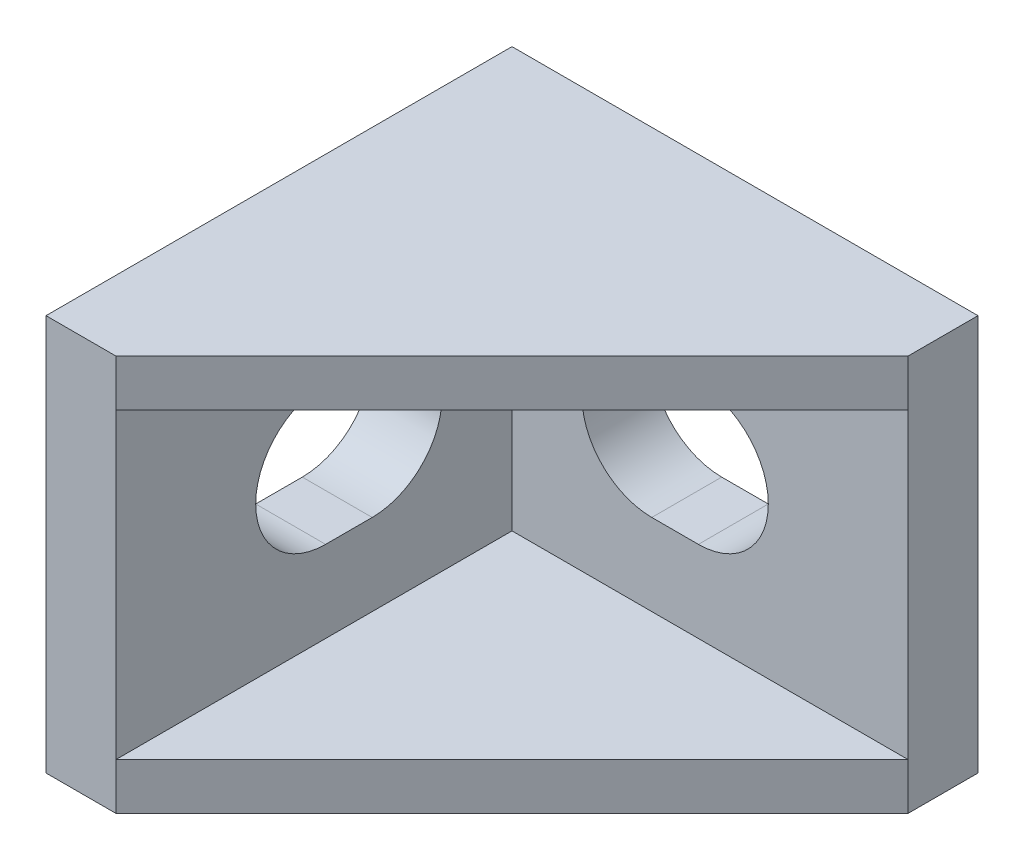
ISO-10303-21;
HEADER;
FILE_DESCRIPTION(('STEP AP214'),'2;1');
FILE_NAME('part.step','',(''),(''),'','','');
FILE_SCHEMA(('AUTOMOTIVE_DESIGN { 1 0 10303 214 1 1 1 1 }'));
ENDSEC;
DATA;
#1=APPLICATION_CONTEXT('core data for automotive mechanical design processes');
#2=APPLICATION_PROTOCOL_DEFINITION('international standard','automotive_design',2000,#1);
#3=PRODUCT_CONTEXT('',#1,'mechanical');
#4=PRODUCT('Part','Part','',(#3));
#5=PRODUCT_RELATED_PRODUCT_CATEGORY('part','',(#4));
#6=PRODUCT_DEFINITION_FORMATION('','',#4);
#7=PRODUCT_DEFINITION_CONTEXT('part definition',#1,'design');
#8=PRODUCT_DEFINITION('design','',#6,#7);
#9=PRODUCT_DEFINITION_SHAPE('','',#8);
#10=(LENGTH_UNIT() NAMED_UNIT(*) SI_UNIT(.MILLI.,.METRE.));
#11=(NAMED_UNIT(*) PLANE_ANGLE_UNIT() SI_UNIT($,.RADIAN.));
#12=(NAMED_UNIT(*) SI_UNIT($,.STERADIAN.) SOLID_ANGLE_UNIT());
#13=UNCERTAINTY_MEASURE_WITH_UNIT(LENGTH_MEASURE(1.E-05),#10,'distance_accuracy_value','');
#14=(GEOMETRIC_REPRESENTATION_CONTEXT(3) GLOBAL_UNCERTAINTY_ASSIGNED_CONTEXT((#13)) GLOBAL_UNIT_ASSIGNED_CONTEXT((#10,
#11,#12)) REPRESENTATION_CONTEXT('',''));
#15=CARTESIAN_POINT('',(0.,0.,0.));
#16=DIRECTION('',(0.,0.,1.));
#17=DIRECTION('',(1.,0.,0.));
#18=AXIS2_PLACEMENT_3D('',#15,#16,#17);
#19=CARTESIAN_POINT('',(20.,17.,3.));
#20=DIRECTION('',(-0.707106781186548,0.,-0.707106781186548));
#21=DIRECTION('',(0.707106781186548,0.,-0.707106781186548));
#22=AXIS2_PLACEMENT_3D('',#19,#20,#21);
#23=PLANE('',#22);
#24=DIRECTION('',(0.,-1.,0.));
#25=VECTOR('',#24,1.);
#26=CARTESIAN_POINT('',(3.,17.,20.));
#27=LINE('',#26,#25);
#28=CARTESIAN_POINT('',(3.,2.,20.));
#29=VERTEX_POINT('',#28);
#30=CARTESIAN_POINT('',(3.,0.,20.));
#31=VERTEX_POINT('',#30);
#32=EDGE_CURVE('E254',#29,#31,#27,.T.);
#33=ORIENTED_EDGE('',*,*,#32,.T.);
#34=DIRECTION('',(-0.707106781186547,0.,0.707106781186547));
#35=VECTOR('',#34,1.);
#36=CARTESIAN_POINT('',(20.,0.,3.));
#37=LINE('',#36,#35);
#38=CARTESIAN_POINT('',(20.,0.,3.));
#39=VERTEX_POINT('',#38);
#40=EDGE_CURVE('E248',#39,#31,#37,.T.);
#41=ORIENTED_EDGE('',*,*,#40,.F.);
#42=DIRECTION('',(0.,-1.,0.));
#43=VECTOR('',#42,1.);
#44=CARTESIAN_POINT('',(20.,17.,3.));
#45=LINE('',#44,#43);
#46=CARTESIAN_POINT('',(20.,2.,3.));
#47=VERTEX_POINT('',#46);
#48=EDGE_CURVE('E258',#47,#39,#45,.T.);
#49=ORIENTED_EDGE('',*,*,#48,.F.);
#50=DIRECTION('',(0.707106781186548,0.,-0.707106781186548));
#51=VECTOR('',#50,1.);
#52=CARTESIAN_POINT('',(20.,2.,3.));
#53=LINE('',#52,#51);
#54=EDGE_CURVE('E11',#29,#47,#53,.T.);
#55=ORIENTED_EDGE('',*,*,#54,.F.);
#56=EDGE_LOOP('',(#33,#41,#49,#55));
#57=FACE_BOUND('',#56,.T.);
#58=ADVANCED_FACE('F35',(#57),#23,.F.);
#59=CARTESIAN_POINT('',(0.,17.,20.));
#60=DIRECTION('',(1.,0.,0.));
#61=DIRECTION('',(0.,0.,1.));
#62=AXIS2_PLACEMENT_3D('',#59,#60,#61);
#63=PLANE('',#62);
#64=DIRECTION('',(0.,0.,1.));
#65=VECTOR('',#64,1.);
#66=CARTESIAN_POINT('',(0.,11.5,9.));
#67=LINE('',#66,#65);
#68=CARTESIAN_POINT('',(0.,11.5,9.));
#69=VERTEX_POINT('',#68);
#70=CARTESIAN_POINT('',(0.,11.5,11.));
#71=VERTEX_POINT('',#70);
#72=EDGE_CURVE('E173',#69,#71,#67,.T.);
#73=ORIENTED_EDGE('',*,*,#72,.T.);
#74=CARTESIAN_POINT('',(0.,8.5,11.));
#75=DIRECTION('',(-1.,0.,0.));
#76=DIRECTION('',(0.,0.,1.));
#77=AXIS2_PLACEMENT_3D('',#74,#75,#76);
#78=CIRCLE('',#77,3.);
#79=CARTESIAN_POINT('',(0.,5.5,11.));
#80=VERTEX_POINT('',#79);
#81=EDGE_CURVE('E170',#71,#80,#78,.F.);
#82=ORIENTED_EDGE('',*,*,#81,.T.);
#83=DIRECTION('',(0.,0.,-1.));
#84=VECTOR('',#83,1.);
#85=CARTESIAN_POINT('',(0.,5.5,9.));
#86=LINE('',#85,#84);
#87=CARTESIAN_POINT('',(0.,5.5,9.));
#88=VERTEX_POINT('',#87);
#89=EDGE_CURVE('E199',#80,#88,#86,.T.);
#90=ORIENTED_EDGE('',*,*,#89,.T.);
#91=CARTESIAN_POINT('',(0.,8.5,9.));
#92=DIRECTION('',(-1.,0.,0.));
#93=DIRECTION('',(0.,0.,1.));
#94=AXIS2_PLACEMENT_3D('',#91,#92,#93);
#95=CIRCLE('',#94,3.);
#96=EDGE_CURVE('E181',#88,#69,#95,.F.);
#97=ORIENTED_EDGE('',*,*,#96,.T.);
#98=EDGE_LOOP('',(#73,#82,#90,#97));
#99=FACE_BOUND('',#98,.T.);
#100=DIRECTION('',(0.,0.,-1.));
#101=VECTOR('',#100,1.);
#102=CARTESIAN_POINT('',(0.,0.,20.));
#103=LINE('',#102,#101);
#104=CARTESIAN_POINT('',(0.,0.,20.));
#105=VERTEX_POINT('',#104);
#106=CARTESIAN_POINT('',(0.,0.,0.));
#107=VERTEX_POINT('',#106);
#108=EDGE_CURVE('E223',#105,#107,#103,.T.);
#109=ORIENTED_EDGE('',*,*,#108,.F.);
#110=DIRECTION('',(0.,-1.,0.));
#111=VECTOR('',#110,1.);
#112=CARTESIAN_POINT('',(0.,17.,20.));
#113=LINE('',#112,#111);
#114=CARTESIAN_POINT('',(0.,17.,20.));
#115=VERTEX_POINT('',#114);
#116=EDGE_CURVE('E240',#115,#105,#113,.T.);
#117=ORIENTED_EDGE('',*,*,#116,.F.);
#118=DIRECTION('',(0.,0.,-1.));
#119=VECTOR('',#118,1.);
#120=CARTESIAN_POINT('',(0.,17.,20.));
#121=LINE('',#120,#119);
#122=CARTESIAN_POINT('',(0.,17.,0.));
#123=VERTEX_POINT('',#122);
#124=EDGE_CURVE('E225',#115,#123,#121,.T.);
#125=ORIENTED_EDGE('',*,*,#124,.T.);
#126=DIRECTION('',(0.,-1.,0.));
#127=VECTOR('',#126,1.);
#128=CARTESIAN_POINT('',(0.,17.,0.));
#129=LINE('',#128,#127);
#130=EDGE_CURVE('E265',#123,#107,#129,.T.);
#131=ORIENTED_EDGE('',*,*,#130,.T.);
#132=EDGE_LOOP('',(#109,#117,#125,#131));
#133=FACE_BOUND('',#132,.T.);
#134=ADVANCED_FACE('F37',(#99,#133),#63,.F.);
#135=CARTESIAN_POINT('',(0.,17.,0.));
#136=DIRECTION('',(0.,0.,1.));
#137=DIRECTION('',(-1.,0.,0.));
#138=AXIS2_PLACEMENT_3D('',#135,#136,#137);
#139=PLANE('',#138);
#140=DIRECTION('',(-1.,0.,0.));
#141=VECTOR('',#140,1.);
#142=CARTESIAN_POINT('',(11.,11.5,0.));
#143=LINE('',#142,#141);
#144=CARTESIAN_POINT('',(11.,11.5,0.));
#145=VERTEX_POINT('',#144);
#146=CARTESIAN_POINT('',(9.,11.5,0.));
#147=VERTEX_POINT('',#146);
#148=EDGE_CURVE('E165',#145,#147,#143,.T.);
#149=ORIENTED_EDGE('',*,*,#148,.T.);
#150=CARTESIAN_POINT('',(9.,8.5,0.));
#151=DIRECTION('',(0.,0.,-1.));
#152=DIRECTION('',(-1.,0.,0.));
#153=AXIS2_PLACEMENT_3D('',#150,#151,#152);
#154=CIRCLE('',#153,3.);
#155=CARTESIAN_POINT('',(9.,5.5,0.));
#156=VERTEX_POINT('',#155);
#157=EDGE_CURVE('E169',#147,#156,#154,.F.);
#158=ORIENTED_EDGE('',*,*,#157,.T.);
#159=DIRECTION('',(1.,0.,0.));
#160=VECTOR('',#159,1.);
#161=CARTESIAN_POINT('',(11.,5.5,0.));
#162=LINE('',#161,#160);
#163=CARTESIAN_POINT('',(11.,5.5,0.));
#164=VERTEX_POINT('',#163);
#165=EDGE_CURVE('E150',#156,#164,#162,.T.);
#166=ORIENTED_EDGE('',*,*,#165,.T.);
#167=CARTESIAN_POINT('',(11.,8.5,0.));
#168=DIRECTION('',(0.,0.,-1.));
#169=DIRECTION('',(-1.,0.,0.));
#170=AXIS2_PLACEMENT_3D('',#167,#168,#169);
#171=CIRCLE('',#170,3.);
#172=EDGE_CURVE('E158',#164,#145,#171,.F.);
#173=ORIENTED_EDGE('',*,*,#172,.T.);
#174=EDGE_LOOP('',(#149,#158,#166,#173));
#175=FACE_BOUND('',#174,.T.);
#176=DIRECTION('',(1.,0.,0.));
#177=VECTOR('',#176,1.);
#178=CARTESIAN_POINT('',(0.,0.,0.));
#179=LINE('',#178,#177);
#180=CARTESIAN_POINT('',(20.,0.,0.));
#181=VERTEX_POINT('',#180);
#182=EDGE_CURVE('E243',#107,#181,#179,.T.);
#183=ORIENTED_EDGE('',*,*,#182,.F.);
#184=ORIENTED_EDGE('',*,*,#130,.F.);
#185=DIRECTION('',(1.,0.,0.));
#186=VECTOR('',#185,1.);
#187=CARTESIAN_POINT('',(0.,17.,0.));
#188=LINE('',#187,#186);
#189=CARTESIAN_POINT('',(20.,17.,0.));
#190=VERTEX_POINT('',#189);
#191=EDGE_CURVE('E228',#123,#190,#188,.T.);
#192=ORIENTED_EDGE('',*,*,#191,.T.);
#193=DIRECTION('',(0.,-1.,0.));
#194=VECTOR('',#193,1.);
#195=CARTESIAN_POINT('',(20.,17.,0.));
#196=LINE('',#195,#194);
#197=EDGE_CURVE('E262',#190,#181,#196,.T.);
#198=ORIENTED_EDGE('',*,*,#197,.T.);
#199=EDGE_LOOP('',(#183,#184,#192,#198));
#200=FACE_BOUND('',#199,.T.);
#201=ADVANCED_FACE('F167',(#175,#200),#139,.F.);
#202=CARTESIAN_POINT('',(20.,17.,0.));
#203=DIRECTION('',(-1.,0.,0.));
#204=DIRECTION('',(0.,0.,-1.));
#205=AXIS2_PLACEMENT_3D('',#202,#203,#204);
#206=PLANE('',#205);
#207=DIRECTION('',(0.,0.,1.));
#208=VECTOR('',#207,1.);
#209=CARTESIAN_POINT('',(20.,0.,0.));
#210=LINE('',#209,#208);
#211=EDGE_CURVE('E246',#181,#39,#210,.T.);
#212=ORIENTED_EDGE('',*,*,#211,.F.);
#213=ORIENTED_EDGE('',*,*,#197,.F.);
#214=DIRECTION('',(0.,0.,1.));
#215=VECTOR('',#214,1.);
#216=CARTESIAN_POINT('',(20.,17.,0.));
#217=LINE('',#216,#215);
#218=CARTESIAN_POINT('',(20.,17.,3.));
#219=VERTEX_POINT('',#218);
#220=EDGE_CURVE('E232',#190,#219,#217,.T.);
#221=ORIENTED_EDGE('',*,*,#220,.T.);
#222=CARTESIAN_POINT('',(20.,15.,3.));
#223=VERTEX_POINT('',#222);
#224=EDGE_CURVE('E259',#219,#223,#45,.T.);
#225=ORIENTED_EDGE('',*,*,#224,.T.);
#226=DIRECTION('',(0.,-1.,0.));
#227=VECTOR('',#226,1.);
#228=CARTESIAN_POINT('',(20.,15.,3.));
#229=LINE('',#228,#227);
#230=EDGE_CURVE('E212',#223,#47,#229,.T.);
#231=ORIENTED_EDGE('',*,*,#230,.T.);
#232=ORIENTED_EDGE('',*,*,#48,.T.);
#233=EDGE_LOOP('',(#212,#213,#221,#225,#231,#232));
#234=FACE_BOUND('',#233,.T.);
#235=ADVANCED_FACE('F297',(#234),#206,.F.);
#236=ORIENTED_EDGE('',*,*,#224,.F.);
#237=DIRECTION('',(-0.707106781186547,0.,0.707106781186547));
#238=VECTOR('',#237,1.);
#239=CARTESIAN_POINT('',(20.,17.,3.));
#240=LINE('',#239,#238);
#241=CARTESIAN_POINT('',(3.,17.,20.));
#242=VERTEX_POINT('',#241);
#243=EDGE_CURVE('E235',#219,#242,#240,.T.);
#244=ORIENTED_EDGE('',*,*,#243,.T.);
#245=CARTESIAN_POINT('',(3.,15.,20.));
#246=VERTEX_POINT('',#245);
#247=EDGE_CURVE('E255',#242,#246,#27,.T.);
#248=ORIENTED_EDGE('',*,*,#247,.T.);
#249=DIRECTION('',(-0.707106781186548,0.,0.707106781186548));
#250=VECTOR('',#249,1.);
#251=CARTESIAN_POINT('',(20.,15.,3.));
#252=LINE('',#251,#250);
#253=EDGE_CURVE('E43',#223,#246,#252,.T.);
#254=ORIENTED_EDGE('',*,*,#253,.F.);
#255=EDGE_LOOP('',(#236,#244,#248,#254));
#256=FACE_BOUND('',#255,.T.);
#257=ADVANCED_FACE('F277',(#256),#23,.F.);
#258=CARTESIAN_POINT('',(3.,17.,20.));
#259=DIRECTION('',(0.,0.,-1.));
#260=DIRECTION('',(1.,0.,0.));
#261=AXIS2_PLACEMENT_3D('',#258,#259,#260);
#262=PLANE('',#261);
#263=DIRECTION('',(-1.,0.,0.));
#264=VECTOR('',#263,1.);
#265=CARTESIAN_POINT('',(3.,0.,20.));
#266=LINE('',#265,#264);
#267=EDGE_CURVE('E229',#31,#105,#266,.T.);
#268=ORIENTED_EDGE('',*,*,#267,.F.);
#269=ORIENTED_EDGE('',*,*,#32,.F.);
#270=DIRECTION('',(0.,1.,0.));
#271=VECTOR('',#270,1.);
#272=CARTESIAN_POINT('',(3.,2.,20.));
#273=LINE('',#272,#271);
#274=EDGE_CURVE('E207',#29,#246,#273,.T.);
#275=ORIENTED_EDGE('',*,*,#274,.T.);
#276=ORIENTED_EDGE('',*,*,#247,.F.);
#277=DIRECTION('',(-1.,0.,0.));
#278=VECTOR('',#277,1.);
#279=CARTESIAN_POINT('',(3.,17.,20.));
#280=LINE('',#279,#278);
#281=EDGE_CURVE('E238',#242,#115,#280,.T.);
#282=ORIENTED_EDGE('',*,*,#281,.T.);
#283=ORIENTED_EDGE('',*,*,#116,.T.);
#284=EDGE_LOOP('',(#268,#269,#275,#276,#282,#283));
#285=FACE_BOUND('',#284,.T.);
#286=ADVANCED_FACE('F279',(#285),#262,.F.);
#287=CARTESIAN_POINT('',(0.,17.,0.));
#288=DIRECTION('',(0.,1.,0.));
#289=DIRECTION('',(0.,0.,-1.));
#290=AXIS2_PLACEMENT_3D('',#287,#288,#289);
#291=PLANE('',#290);
#292=ORIENTED_EDGE('',*,*,#124,.F.);
#293=ORIENTED_EDGE('',*,*,#281,.F.);
#294=ORIENTED_EDGE('',*,*,#243,.F.);
#295=ORIENTED_EDGE('',*,*,#220,.F.);
#296=ORIENTED_EDGE('',*,*,#191,.F.);
#297=EDGE_LOOP('',(#292,#293,#294,#295,#296));
#298=FACE_BOUND('',#297,.T.);
#299=ADVANCED_FACE('F300',(#298),#291,.T.);
#300=CARTESIAN_POINT('',(0.,0.,0.));
#301=DIRECTION('',(0.,1.,0.));
#302=DIRECTION('',(0.,0.,-1.));
#303=AXIS2_PLACEMENT_3D('',#300,#301,#302);
#304=PLANE('',#303);
#305=ORIENTED_EDGE('',*,*,#108,.T.);
#306=ORIENTED_EDGE('',*,*,#182,.T.);
#307=ORIENTED_EDGE('',*,*,#211,.T.);
#308=ORIENTED_EDGE('',*,*,#40,.T.);
#309=ORIENTED_EDGE('',*,*,#267,.T.);
#310=EDGE_LOOP('',(#305,#306,#307,#308,#309));
#311=FACE_BOUND('',#310,.T.);
#312=ADVANCED_FACE('F306',(#311),#304,.F.);
#313=CARTESIAN_POINT('',(20.,2.,3.));
#314=DIRECTION('',(0.,-1.,0.));
#315=DIRECTION('',(0.,0.,1.));
#316=AXIS2_PLACEMENT_3D('',#313,#314,#315);
#317=PLANE('',#316);
#318=DIRECTION('',(0.,0.,1.));
#319=VECTOR('',#318,1.);
#320=CARTESIAN_POINT('',(3.,2.,3.));
#321=LINE('',#320,#319);
#322=CARTESIAN_POINT('',(3.,2.,3.));
#323=VERTEX_POINT('',#322);
#324=EDGE_CURVE('E221',#323,#29,#321,.T.);
#325=ORIENTED_EDGE('',*,*,#324,.T.);
#326=ORIENTED_EDGE('',*,*,#54,.T.);
#327=DIRECTION('',(-1.,0.,0.));
#328=VECTOR('',#327,1.);
#329=CARTESIAN_POINT('',(20.,2.,3.));
#330=LINE('',#329,#328);
#331=EDGE_CURVE('E215',#47,#323,#330,.T.);
#332=ORIENTED_EDGE('',*,*,#331,.T.);
#333=EDGE_LOOP('',(#325,#326,#332));
#334=FACE_BOUND('',#333,.T.);
#335=ADVANCED_FACE('F293',(#334),#317,.F.);
#336=CARTESIAN_POINT('',(3.,15.,3.));
#337=DIRECTION('',(0.,1.,0.));
#338=DIRECTION('',(-1.,0.,0.));
#339=AXIS2_PLACEMENT_3D('',#336,#337,#338);
#340=PLANE('',#339);
#341=DIRECTION('',(1.,0.,0.));
#342=VECTOR('',#341,1.);
#343=CARTESIAN_POINT('',(3.,15.,3.));
#344=LINE('',#343,#342);
#345=CARTESIAN_POINT('',(3.,15.,3.));
#346=VERTEX_POINT('',#345);
#347=EDGE_CURVE('E210',#346,#223,#344,.T.);
#348=ORIENTED_EDGE('',*,*,#347,.T.);
#349=ORIENTED_EDGE('',*,*,#253,.T.);
#350=DIRECTION('',(0.,0.,1.));
#351=VECTOR('',#350,1.);
#352=CARTESIAN_POINT('',(3.,15.,3.));
#353=LINE('',#352,#351);
#354=EDGE_CURVE('E218',#346,#246,#353,.T.);
#355=ORIENTED_EDGE('',*,*,#354,.F.);
#356=EDGE_LOOP('',(#348,#349,#355));
#357=FACE_BOUND('',#356,.T.);
#358=ADVANCED_FACE('F271',(#357),#340,.F.);
#359=CARTESIAN_POINT('',(3.,2.,3.));
#360=DIRECTION('',(-1.,0.,0.));
#361=DIRECTION('',(0.,0.,-1.));
#362=AXIS2_PLACEMENT_3D('',#359,#360,#361);
#363=PLANE('',#362);
#364=DIRECTION('',(0.,0.,1.));
#365=VECTOR('',#364,1.);
#366=CARTESIAN_POINT('',(3.,5.5,9.));
#367=LINE('',#366,#365);
#368=CARTESIAN_POINT('',(3.,5.5,9.));
#369=VERTEX_POINT('',#368);
#370=CARTESIAN_POINT('',(3.,5.5,11.));
#371=VERTEX_POINT('',#370);
#372=EDGE_CURVE('E187',#369,#371,#367,.T.);
#373=ORIENTED_EDGE('',*,*,#372,.T.);
#374=CARTESIAN_POINT('',(3.,8.5,11.));
#375=DIRECTION('',(-1.,0.,0.));
#376=DIRECTION('',(0.,0.,1.));
#377=AXIS2_PLACEMENT_3D('',#374,#375,#376);
#378=CIRCLE('',#377,3.);
#379=CARTESIAN_POINT('',(3.,11.5,11.));
#380=VERTEX_POINT('',#379);
#381=EDGE_CURVE('E190',#371,#380,#378,.T.);
#382=ORIENTED_EDGE('',*,*,#381,.T.);
#383=DIRECTION('',(0.,0.,-1.));
#384=VECTOR('',#383,1.);
#385=CARTESIAN_POINT('',(3.,11.5,9.));
#386=LINE('',#385,#384);
#387=CARTESIAN_POINT('',(3.,11.5,9.));
#388=VERTEX_POINT('',#387);
#389=EDGE_CURVE('E193',#380,#388,#386,.T.);
#390=ORIENTED_EDGE('',*,*,#389,.T.);
#391=CARTESIAN_POINT('',(3.,8.5,9.));
#392=DIRECTION('',(-1.,0.,0.));
#393=DIRECTION('',(0.,0.,1.));
#394=AXIS2_PLACEMENT_3D('',#391,#392,#393);
#395=CIRCLE('',#394,3.);
#396=EDGE_CURVE('E184',#388,#369,#395,.T.);
#397=ORIENTED_EDGE('',*,*,#396,.T.);
#398=EDGE_LOOP('',(#373,#382,#390,#397));
#399=FACE_BOUND('',#398,.T.);
#400=ORIENTED_EDGE('',*,*,#274,.F.);
#401=ORIENTED_EDGE('',*,*,#324,.F.);
#402=DIRECTION('',(0.,1.,0.));
#403=VECTOR('',#402,1.);
#404=CARTESIAN_POINT('',(3.,2.,3.));
#405=LINE('',#404,#403);
#406=EDGE_CURVE('E208',#323,#346,#405,.T.);
#407=ORIENTED_EDGE('',*,*,#406,.T.);
#408=ORIENTED_EDGE('',*,*,#354,.T.);
#409=EDGE_LOOP('',(#400,#401,#407,#408));
#410=FACE_BOUND('',#409,.T.);
#411=ADVANCED_FACE('F287',(#399,#410),#363,.F.);
#412=CARTESIAN_POINT('',(0.,0.,3.));
#413=DIRECTION('',(0.,0.,1.));
#414=DIRECTION('',(-1.,0.,0.));
#415=AXIS2_PLACEMENT_3D('',#412,#413,#414);
#416=PLANE('',#415);
#417=CARTESIAN_POINT('',(11.,8.5,3.));
#418=DIRECTION('',(0.,0.,-1.));
#419=DIRECTION('',(-1.,0.,0.));
#420=AXIS2_PLACEMENT_3D('',#417,#418,#419);
#421=CIRCLE('',#420,3.);
#422=CARTESIAN_POINT('',(11.,11.5,3.));
#423=VERTEX_POINT('',#422);
#424=CARTESIAN_POINT('',(11.,5.5,3.));
#425=VERTEX_POINT('',#424);
#426=EDGE_CURVE('E164',#423,#425,#421,.T.);
#427=ORIENTED_EDGE('',*,*,#426,.T.);
#428=DIRECTION('',(-1.,0.,0.));
#429=VECTOR('',#428,1.);
#430=CARTESIAN_POINT('',(11.,5.5,3.));
#431=LINE('',#430,#429);
#432=CARTESIAN_POINT('',(9.,5.5,3.));
#433=VERTEX_POINT('',#432);
#434=EDGE_CURVE('E153',#425,#433,#431,.T.);
#435=ORIENTED_EDGE('',*,*,#434,.T.);
#436=CARTESIAN_POINT('',(9.,8.5,3.));
#437=DIRECTION('',(0.,0.,-1.));
#438=DIRECTION('',(-1.,0.,0.));
#439=AXIS2_PLACEMENT_3D('',#436,#437,#438);
#440=CIRCLE('',#439,3.);
#441=CARTESIAN_POINT('',(9.,11.5,3.));
#442=VERTEX_POINT('',#441);
#443=EDGE_CURVE('E375',#433,#442,#440,.T.);
#444=ORIENTED_EDGE('',*,*,#443,.T.);
#445=DIRECTION('',(1.,0.,0.));
#446=VECTOR('',#445,1.);
#447=CARTESIAN_POINT('',(11.,11.5,3.));
#448=LINE('',#447,#446);
#449=EDGE_CURVE('E155',#442,#423,#448,.T.);
#450=ORIENTED_EDGE('',*,*,#449,.T.);
#451=EDGE_LOOP('',(#427,#435,#444,#450));
#452=FACE_BOUND('',#451,.T.);
#453=ORIENTED_EDGE('',*,*,#406,.F.);
#454=ORIENTED_EDGE('',*,*,#331,.F.);
#455=ORIENTED_EDGE('',*,*,#230,.F.);
#456=ORIENTED_EDGE('',*,*,#347,.F.);
#457=EDGE_LOOP('',(#453,#454,#455,#456));
#458=FACE_BOUND('',#457,.T.);
#459=ADVANCED_FACE('F295',(#452,#458),#416,.T.);
#460=CARTESIAN_POINT('',(-0.00100000000000013,8.5,9.));
#461=DIRECTION('',(1.,0.,0.));
#462=DIRECTION('',(0.,0.,1.));
#463=AXIS2_PLACEMENT_3D('',#460,#461,#462);
#464=CYLINDRICAL_SURFACE('',#463,3.);
#465=ORIENTED_EDGE('',*,*,#96,.F.);
#466=DIRECTION('',(1.,0.,0.));
#467=VECTOR('',#466,1.);
#468=CARTESIAN_POINT('',(-0.00100000000000013,5.5,9.));
#469=LINE('',#468,#467);
#470=EDGE_CURVE('E196',#88,#369,#469,.T.);
#471=ORIENTED_EDGE('',*,*,#470,.T.);
#472=ORIENTED_EDGE('',*,*,#396,.F.);
#473=DIRECTION('',(1.,0.,0.));
#474=VECTOR('',#473,1.);
#475=CARTESIAN_POINT('',(-0.00100000000000013,11.5,9.));
#476=LINE('',#475,#474);
#477=EDGE_CURVE('E197',#69,#388,#476,.T.);
#478=ORIENTED_EDGE('',*,*,#477,.F.);
#479=EDGE_LOOP('',(#465,#471,#472,#478));
#480=FACE_BOUND('',#479,.T.);
#481=ADVANCED_FACE('F339',(#480),#464,.F.);
#482=CARTESIAN_POINT('',(-0.00100000000000013,11.5,9.));
#483=DIRECTION('',(0.,1.,0.));
#484=DIRECTION('',(0.,0.,-1.));
#485=AXIS2_PLACEMENT_3D('',#482,#483,#484);
#486=PLANE('',#485);
#487=ORIENTED_EDGE('',*,*,#72,.F.);
#488=ORIENTED_EDGE('',*,*,#477,.T.);
#489=ORIENTED_EDGE('',*,*,#389,.F.);
#490=DIRECTION('',(1.,0.,0.));
#491=VECTOR('',#490,1.);
#492=CARTESIAN_POINT('',(-0.00100000000000013,11.5,11.));
#493=LINE('',#492,#491);
#494=EDGE_CURVE('E200',#71,#380,#493,.T.);
#495=ORIENTED_EDGE('',*,*,#494,.F.);
#496=EDGE_LOOP('',(#487,#488,#489,#495));
#497=FACE_BOUND('',#496,.T.);
#498=ADVANCED_FACE('F343',(#497),#486,.F.);
#499=CARTESIAN_POINT('',(-0.00100000000000013,8.5,11.));
#500=DIRECTION('',(1.,0.,0.));
#501=DIRECTION('',(0.,0.,1.));
#502=AXIS2_PLACEMENT_3D('',#499,#500,#501);
#503=CYLINDRICAL_SURFACE('',#502,3.);
#504=ORIENTED_EDGE('',*,*,#81,.F.);
#505=ORIENTED_EDGE('',*,*,#494,.T.);
#506=ORIENTED_EDGE('',*,*,#381,.F.);
#507=DIRECTION('',(1.,0.,0.));
#508=VECTOR('',#507,1.);
#509=CARTESIAN_POINT('',(-0.00100000000000013,5.5,11.));
#510=LINE('',#509,#508);
#511=EDGE_CURVE('E202',#80,#371,#510,.T.);
#512=ORIENTED_EDGE('',*,*,#511,.F.);
#513=EDGE_LOOP('',(#504,#505,#506,#512));
#514=FACE_BOUND('',#513,.T.);
#515=ADVANCED_FACE('F348',(#514),#503,.F.);
#516=CARTESIAN_POINT('',(-0.00100000000000013,5.5,9.));
#517=DIRECTION('',(0.,-1.,0.));
#518=DIRECTION('',(0.,0.,1.));
#519=AXIS2_PLACEMENT_3D('',#516,#517,#518);
#520=PLANE('',#519);
#521=ORIENTED_EDGE('',*,*,#89,.F.);
#522=ORIENTED_EDGE('',*,*,#511,.T.);
#523=ORIENTED_EDGE('',*,*,#372,.F.);
#524=ORIENTED_EDGE('',*,*,#470,.F.);
#525=EDGE_LOOP('',(#521,#522,#523,#524));
#526=FACE_BOUND('',#525,.T.);
#527=ADVANCED_FACE('F345',(#526),#520,.F.);
#528=CARTESIAN_POINT('',(11.,8.5,-0.00100000000000013));
#529=DIRECTION('',(0.,0.,1.));
#530=DIRECTION('',(-1.,0.,0.));
#531=AXIS2_PLACEMENT_3D('',#528,#529,#530);
#532=CYLINDRICAL_SURFACE('',#531,3.);
#533=ORIENTED_EDGE('',*,*,#172,.F.);
#534=DIRECTION('',(0.,0.,1.));
#535=VECTOR('',#534,1.);
#536=CARTESIAN_POINT('',(11.,5.5,-0.00100000000000013));
#537=LINE('',#536,#535);
#538=EDGE_CURVE('E58',#164,#425,#537,.T.);
#539=ORIENTED_EDGE('',*,*,#538,.T.);
#540=ORIENTED_EDGE('',*,*,#426,.F.);
#541=DIRECTION('',(0.,0.,1.));
#542=VECTOR('',#541,1.);
#543=CARTESIAN_POINT('',(11.,11.5,-0.00100000000000013));
#544=LINE('',#543,#542);
#545=EDGE_CURVE('E160',#145,#423,#544,.T.);
#546=ORIENTED_EDGE('',*,*,#545,.F.);
#547=EDGE_LOOP('',(#533,#539,#540,#546));
#548=FACE_BOUND('',#547,.T.);
#549=ADVANCED_FACE('F159',(#548),#532,.F.);
#550=CARTESIAN_POINT('',(11.,11.5,-0.00100000000000013));
#551=DIRECTION('',(0.,1.,0.));
#552=DIRECTION('',(0.,0.,-1.));
#553=AXIS2_PLACEMENT_3D('',#550,#551,#552);
#554=PLANE('',#553);
#555=ORIENTED_EDGE('',*,*,#148,.F.);
#556=ORIENTED_EDGE('',*,*,#545,.T.);
#557=ORIENTED_EDGE('',*,*,#449,.F.);
#558=DIRECTION('',(0.,0.,1.));
#559=VECTOR('',#558,1.);
#560=CARTESIAN_POINT('',(9.,11.5,-0.00100000000000013));
#561=LINE('',#560,#559);
#562=EDGE_CURVE('E175',#147,#442,#561,.T.);
#563=ORIENTED_EDGE('',*,*,#562,.F.);
#564=EDGE_LOOP('',(#555,#556,#557,#563));
#565=FACE_BOUND('',#564,.T.);
#566=ADVANCED_FACE('F358',(#565),#554,.F.);
#567=CARTESIAN_POINT('',(9.,8.5,-0.00100000000000013));
#568=DIRECTION('',(0.,0.,1.));
#569=DIRECTION('',(-1.,0.,0.));
#570=AXIS2_PLACEMENT_3D('',#567,#568,#569);
#571=CYLINDRICAL_SURFACE('',#570,3.);
#572=ORIENTED_EDGE('',*,*,#157,.F.);
#573=ORIENTED_EDGE('',*,*,#562,.T.);
#574=ORIENTED_EDGE('',*,*,#443,.F.);
#575=DIRECTION('',(0.,0.,1.));
#576=VECTOR('',#575,1.);
#577=CARTESIAN_POINT('',(9.,5.5,-0.00100000000000013));
#578=LINE('',#577,#576);
#579=EDGE_CURVE('E50',#156,#433,#578,.T.);
#580=ORIENTED_EDGE('',*,*,#579,.F.);
#581=EDGE_LOOP('',(#572,#573,#574,#580));
#582=FACE_BOUND('',#581,.T.);
#583=ADVANCED_FACE('F361',(#582),#571,.F.);
#584=CARTESIAN_POINT('',(11.,5.5,-0.00100000000000013));
#585=DIRECTION('',(0.,-1.,0.));
#586=DIRECTION('',(0.,0.,1.));
#587=AXIS2_PLACEMENT_3D('',#584,#585,#586);
#588=PLANE('',#587);
#589=ORIENTED_EDGE('',*,*,#165,.F.);
#590=ORIENTED_EDGE('',*,*,#579,.T.);
#591=ORIENTED_EDGE('',*,*,#434,.F.);
#592=ORIENTED_EDGE('',*,*,#538,.F.);
#593=EDGE_LOOP('',(#589,#590,#591,#592));
#594=FACE_BOUND('',#593,.T.);
#595=ADVANCED_FACE('F148',(#594),#588,.F.);
#596=CLOSED_SHELL('',(#58,#134,#201,#235,#257,#286,#299,#312,#335,#358,#411,#459,#481,#498,#515,
#527,#549,#566,#583,#595));
#597=MANIFOLD_SOLID_BREP('B2',#596);
#598=ADVANCED_BREP_SHAPE_REPRESENTATION('',(#18,#597),#14);
#599=SHAPE_DEFINITION_REPRESENTATION(#9,#598);
ENDSEC;
END-ISO-10303-21;
